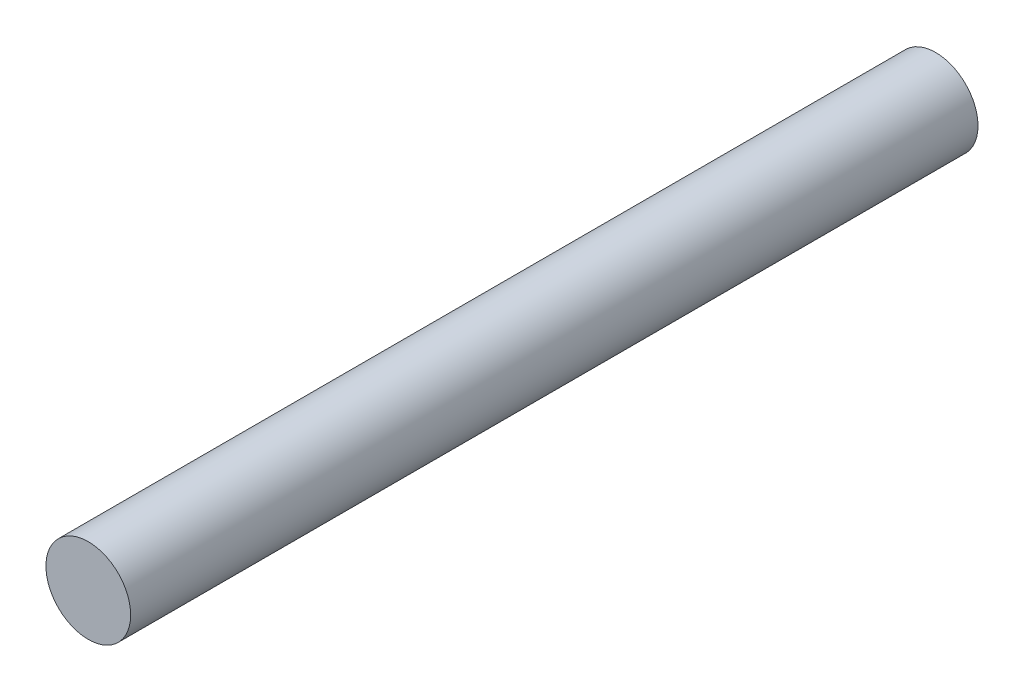
ISO-10303-21;
HEADER;
FILE_DESCRIPTION(('STEP AP214'),'2;1');
FILE_NAME('part.step','',(''),(''),'','','');
FILE_SCHEMA(('AUTOMOTIVE_DESIGN { 1 0 10303 214 1 1 1 1 }'));
ENDSEC;
DATA;
#1=APPLICATION_CONTEXT('core data for automotive mechanical design processes');
#2=APPLICATION_PROTOCOL_DEFINITION('international standard','automotive_design',2000,#1);
#3=PRODUCT_CONTEXT('',#1,'mechanical');
#4=PRODUCT('Part','Part','',(#3));
#5=PRODUCT_RELATED_PRODUCT_CATEGORY('part','',(#4));
#6=PRODUCT_DEFINITION_FORMATION('','',#4);
#7=PRODUCT_DEFINITION_CONTEXT('part definition',#1,'design');
#8=PRODUCT_DEFINITION('design','',#6,#7);
#9=PRODUCT_DEFINITION_SHAPE('','',#8);
#10=(LENGTH_UNIT() NAMED_UNIT(*) SI_UNIT(.MILLI.,.METRE.));
#11=(NAMED_UNIT(*) PLANE_ANGLE_UNIT() SI_UNIT($,.RADIAN.));
#12=(NAMED_UNIT(*) SI_UNIT($,.STERADIAN.) SOLID_ANGLE_UNIT());
#13=UNCERTAINTY_MEASURE_WITH_UNIT(LENGTH_MEASURE(1.E-05),#10,'distance_accuracy_value','');
#14=(GEOMETRIC_REPRESENTATION_CONTEXT(3) GLOBAL_UNCERTAINTY_ASSIGNED_CONTEXT((#13)) GLOBAL_UNIT_ASSIGNED_CONTEXT((#10,
#11,#12)) REPRESENTATION_CONTEXT('',''));
#15=CARTESIAN_POINT('',(0.,0.,0.));
#16=DIRECTION('',(0.,0.,1.));
#17=DIRECTION('',(1.,0.,0.));
#18=AXIS2_PLACEMENT_3D('',#15,#16,#17);
#19=CARTESIAN_POINT('',(0.,0.,40.));
#20=DIRECTION('',(0.,0.,-1.));
#21=DIRECTION('',(-1.,0.,0.));
#22=AXIS2_PLACEMENT_3D('',#19,#20,#21);
#23=CYLINDRICAL_SURFACE('',#22,2.);
#24=CARTESIAN_POINT('',(0.,0.,40.));
#25=DIRECTION('',(0.,0.,1.));
#26=DIRECTION('',(1.,0.,0.));
#27=AXIS2_PLACEMENT_3D('',#24,#25,#26);
#28=CIRCLE('',#27,2.);
#29=CARTESIAN_POINT('',(2.,0.,40.));
#30=VERTEX_POINT('',#29);
#31=EDGE_CURVE('E10',#30,#30,#28,.T.);
#32=ORIENTED_EDGE('',*,*,#31,.F.);
#33=EDGE_LOOP('',(#32));
#34=FACE_BOUND('',#33,.T.);
#35=CARTESIAN_POINT('',(0.,0.,0.));
#36=DIRECTION('',(0.,0.,1.));
#37=DIRECTION('',(1.,0.,0.));
#38=AXIS2_PLACEMENT_3D('',#35,#36,#37);
#39=CIRCLE('',#38,2.);
#40=CARTESIAN_POINT('',(2.,0.,0.));
#41=VERTEX_POINT('',#40);
#42=EDGE_CURVE('E35',#41,#41,#39,.T.);
#43=ORIENTED_EDGE('',*,*,#42,.T.);
#44=EDGE_LOOP('',(#43));
#45=FACE_BOUND('',#44,.T.);
#46=ADVANCED_FACE('F32',(#34,#45),#23,.T.);
#47=CARTESIAN_POINT('',(0.,0.,40.));
#48=DIRECTION('',(0.,0.,1.));
#49=DIRECTION('',(1.,0.,0.));
#50=AXIS2_PLACEMENT_3D('',#47,#48,#49);
#51=PLANE('',#50);
#52=ORIENTED_EDGE('',*,*,#31,.T.);
#53=EDGE_LOOP('',(#52));
#54=FACE_BOUND('',#53,.T.);
#55=ADVANCED_FACE('F47',(#54),#51,.T.);
#56=CARTESIAN_POINT('',(0.,0.,0.));
#57=DIRECTION('',(0.,0.,1.));
#58=DIRECTION('',(1.,0.,0.));
#59=AXIS2_PLACEMENT_3D('',#56,#57,#58);
#60=PLANE('',#59);
#61=ORIENTED_EDGE('',*,*,#42,.F.);
#62=EDGE_LOOP('',(#61));
#63=FACE_BOUND('',#62,.T.);
#64=ADVANCED_FACE('F45',(#63),#60,.F.);
#65=CLOSED_SHELL('',(#46,#55,#64));
#66=MANIFOLD_SOLID_BREP('B2',#65);
#67=ADVANCED_BREP_SHAPE_REPRESENTATION('',(#18,#66),#14);
#68=SHAPE_DEFINITION_REPRESENTATION(#9,#67);
ENDSEC;
END-ISO-10303-21;
